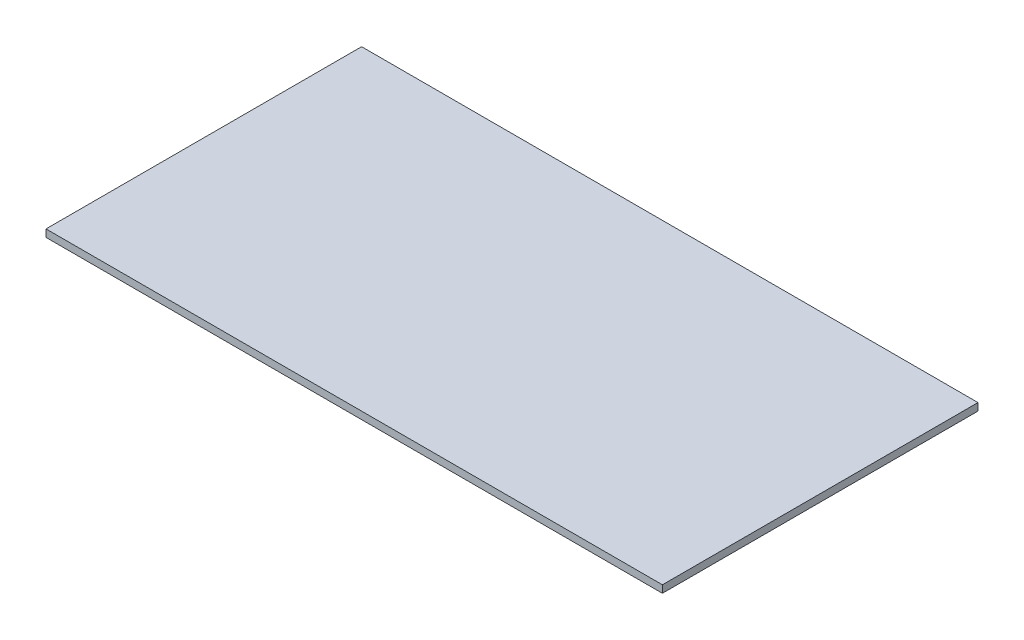
ISO-10303-21;
HEADER;
FILE_DESCRIPTION(('STEP AP214'),'2;1');
FILE_NAME('part.step','',(''),(''),'','','');
FILE_SCHEMA(('AUTOMOTIVE_DESIGN { 1 0 10303 214 1 1 1 1 }'));
ENDSEC;
DATA;
#1=APPLICATION_CONTEXT('core data for automotive mechanical design processes');
#2=APPLICATION_PROTOCOL_DEFINITION('international standard','automotive_design',2000,#1);
#3=PRODUCT_CONTEXT('',#1,'mechanical');
#4=PRODUCT('Part','Part','',(#3));
#5=PRODUCT_RELATED_PRODUCT_CATEGORY('part','',(#4));
#6=PRODUCT_DEFINITION_FORMATION('','',#4);
#7=PRODUCT_DEFINITION_CONTEXT('part definition',#1,'design');
#8=PRODUCT_DEFINITION('design','',#6,#7);
#9=PRODUCT_DEFINITION_SHAPE('','',#8);
#10=(LENGTH_UNIT() NAMED_UNIT(*) SI_UNIT(.MILLI.,.METRE.));
#11=(NAMED_UNIT(*) PLANE_ANGLE_UNIT() SI_UNIT($,.RADIAN.));
#12=(NAMED_UNIT(*) SI_UNIT($,.STERADIAN.) SOLID_ANGLE_UNIT());
#13=UNCERTAINTY_MEASURE_WITH_UNIT(LENGTH_MEASURE(1.E-05),#10,'distance_accuracy_value','');
#14=(GEOMETRIC_REPRESENTATION_CONTEXT(3) GLOBAL_UNCERTAINTY_ASSIGNED_CONTEXT((#13)) GLOBAL_UNIT_ASSIGNED_CONTEXT((#10,
#11,#12)) REPRESENTATION_CONTEXT('',''));
#15=CARTESIAN_POINT('',(0.,0.,0.));
#16=DIRECTION('',(0.,0.,1.));
#17=DIRECTION('',(1.,0.,0.));
#18=AXIS2_PLACEMENT_3D('',#15,#16,#17);
#19=CARTESIAN_POINT('',(0.,3.,0.));
#20=DIRECTION('',(-1.,0.,0.));
#21=DIRECTION('',(0.,0.,1.));
#22=AXIS2_PLACEMENT_3D('',#19,#20,#21);
#23=PLANE('',#22);
#24=DIRECTION('',(0.,0.,-1.));
#25=VECTOR('',#24,1.);
#26=CARTESIAN_POINT('',(0.,0.,0.));
#27=LINE('',#26,#25);
#28=CARTESIAN_POINT('',(0.,0.,0.));
#29=VERTEX_POINT('',#28);
#30=CARTESIAN_POINT('',(0.,0.,-128.));
#31=VERTEX_POINT('',#30);
#32=EDGE_CURVE('E98',#29,#31,#27,.T.);
#33=ORIENTED_EDGE('',*,*,#32,.F.);
#34=DIRECTION('',(0.,-1.,0.));
#35=VECTOR('',#34,1.);
#36=CARTESIAN_POINT('',(0.,3.,0.));
#37=LINE('',#36,#35);
#38=CARTESIAN_POINT('',(0.,3.,0.));
#39=VERTEX_POINT('',#38);
#40=EDGE_CURVE('E11',#39,#29,#37,.T.);
#41=ORIENTED_EDGE('',*,*,#40,.F.);
#42=DIRECTION('',(0.,0.,-1.));
#43=VECTOR('',#42,1.);
#44=CARTESIAN_POINT('',(0.,3.,0.));
#45=LINE('',#44,#43);
#46=CARTESIAN_POINT('',(0.,3.,-128.));
#47=VERTEX_POINT('',#46);
#48=EDGE_CURVE('E93',#39,#47,#45,.T.);
#49=ORIENTED_EDGE('',*,*,#48,.T.);
#50=DIRECTION('',(0.,-1.,0.));
#51=VECTOR('',#50,1.);
#52=CARTESIAN_POINT('',(0.,3.,-128.));
#53=LINE('',#52,#51);
#54=EDGE_CURVE('E36',#47,#31,#53,.T.);
#55=ORIENTED_EDGE('',*,*,#54,.T.);
#56=EDGE_LOOP('',(#33,#41,#49,#55));
#57=FACE_BOUND('',#56,.T.);
#58=ADVANCED_FACE('F33',(#57),#23,.T.);
#59=CARTESIAN_POINT('',(0.,3.,0.));
#60=DIRECTION('',(0.,0.,-1.));
#61=DIRECTION('',(-1.,0.,0.));
#62=AXIS2_PLACEMENT_3D('',#59,#60,#61);
#63=PLANE('',#62);
#64=DIRECTION('',(1.,0.,0.));
#65=VECTOR('',#64,1.);
#66=CARTESIAN_POINT('',(0.,0.,0.));
#67=LINE('',#66,#65);
#68=CARTESIAN_POINT('',(250.,0.,0.));
#69=VERTEX_POINT('',#68);
#70=EDGE_CURVE('E66',#29,#69,#67,.T.);
#71=ORIENTED_EDGE('',*,*,#70,.T.);
#72=DIRECTION('',(0.,-1.,0.));
#73=VECTOR('',#72,1.);
#74=CARTESIAN_POINT('',(250.,3.,0.));
#75=LINE('',#74,#73);
#76=CARTESIAN_POINT('',(250.,3.,0.));
#77=VERTEX_POINT('',#76);
#78=EDGE_CURVE('E42',#77,#69,#75,.T.);
#79=ORIENTED_EDGE('',*,*,#78,.F.);
#80=DIRECTION('',(1.,0.,0.));
#81=VECTOR('',#80,1.);
#82=CARTESIAN_POINT('',(0.,3.,0.));
#83=LINE('',#82,#81);
#84=EDGE_CURVE('E83',#39,#77,#83,.T.);
#85=ORIENTED_EDGE('',*,*,#84,.F.);
#86=ORIENTED_EDGE('',*,*,#40,.T.);
#87=EDGE_LOOP('',(#71,#79,#85,#86));
#88=FACE_BOUND('',#87,.T.);
#89=ADVANCED_FACE('F108',(#88),#63,.F.);
#90=CARTESIAN_POINT('',(250.,3.,0.));
#91=DIRECTION('',(-1.,0.,0.));
#92=DIRECTION('',(0.,0.,1.));
#93=AXIS2_PLACEMENT_3D('',#90,#91,#92);
#94=PLANE('',#93);
#95=DIRECTION('',(0.,0.,-1.));
#96=VECTOR('',#95,1.);
#97=CARTESIAN_POINT('',(250.,0.,0.));
#98=LINE('',#97,#96);
#99=CARTESIAN_POINT('',(250.,0.,-128.));
#100=VERTEX_POINT('',#99);
#101=EDGE_CURVE('E90',#69,#100,#98,.T.);
#102=ORIENTED_EDGE('',*,*,#101,.T.);
#103=DIRECTION('',(0.,-1.,0.));
#104=VECTOR('',#103,1.);
#105=CARTESIAN_POINT('',(250.,3.,-128.));
#106=LINE('',#105,#104);
#107=CARTESIAN_POINT('',(250.,3.,-128.));
#108=VERTEX_POINT('',#107);
#109=EDGE_CURVE('E87',#108,#100,#106,.T.);
#110=ORIENTED_EDGE('',*,*,#109,.F.);
#111=DIRECTION('',(0.,0.,-1.));
#112=VECTOR('',#111,1.);
#113=CARTESIAN_POINT('',(250.,3.,0.));
#114=LINE('',#113,#112);
#115=EDGE_CURVE('E78',#77,#108,#114,.T.);
#116=ORIENTED_EDGE('',*,*,#115,.F.);
#117=ORIENTED_EDGE('',*,*,#78,.T.);
#118=EDGE_LOOP('',(#102,#110,#116,#117));
#119=FACE_BOUND('',#118,.T.);
#120=ADVANCED_FACE('F88',(#119),#94,.F.);
#121=CARTESIAN_POINT('',(0.,3.,-128.));
#122=DIRECTION('',(0.,0.,-1.));
#123=DIRECTION('',(-1.,0.,0.));
#124=AXIS2_PLACEMENT_3D('',#121,#122,#123);
#125=PLANE('',#124);
#126=DIRECTION('',(1.,0.,0.));
#127=VECTOR('',#126,1.);
#128=CARTESIAN_POINT('',(0.,0.,-128.));
#129=LINE('',#128,#127);
#130=EDGE_CURVE('E101',#31,#100,#129,.T.);
#131=ORIENTED_EDGE('',*,*,#130,.F.);
#132=ORIENTED_EDGE('',*,*,#54,.F.);
#133=DIRECTION('',(1.,0.,0.));
#134=VECTOR('',#133,1.);
#135=CARTESIAN_POINT('',(0.,3.,-128.));
#136=LINE('',#135,#134);
#137=EDGE_CURVE('E82',#47,#108,#136,.T.);
#138=ORIENTED_EDGE('',*,*,#137,.T.);
#139=ORIENTED_EDGE('',*,*,#109,.T.);
#140=EDGE_LOOP('',(#131,#132,#138,#139));
#141=FACE_BOUND('',#140,.T.);
#142=ADVANCED_FACE('F92',(#141),#125,.T.);
#143=CARTESIAN_POINT('',(0.,3.,0.));
#144=DIRECTION('',(0.,-1.,0.));
#145=DIRECTION('',(0.,0.,-1.));
#146=AXIS2_PLACEMENT_3D('',#143,#144,#145);
#147=PLANE('',#146);
#148=ORIENTED_EDGE('',*,*,#48,.F.);
#149=ORIENTED_EDGE('',*,*,#84,.T.);
#150=ORIENTED_EDGE('',*,*,#115,.T.);
#151=ORIENTED_EDGE('',*,*,#137,.F.);
#152=EDGE_LOOP('',(#148,#149,#150,#151));
#153=FACE_BOUND('',#152,.T.);
#154=ADVANCED_FACE('F81',(#153),#147,.F.);
#155=CARTESIAN_POINT('',(0.,0.,0.));
#156=DIRECTION('',(0.,-1.,0.));
#157=DIRECTION('',(0.,0.,-1.));
#158=AXIS2_PLACEMENT_3D('',#155,#156,#157);
#159=PLANE('',#158);
#160=ORIENTED_EDGE('',*,*,#32,.T.);
#161=ORIENTED_EDGE('',*,*,#130,.T.);
#162=ORIENTED_EDGE('',*,*,#101,.F.);
#163=ORIENTED_EDGE('',*,*,#70,.F.);
#164=EDGE_LOOP('',(#160,#161,#162,#163));
#165=FACE_BOUND('',#164,.T.);
#166=ADVANCED_FACE('F106',(#165),#159,.T.);
#167=CLOSED_SHELL('',(#58,#89,#120,#142,#154,#166));
#168=MANIFOLD_SOLID_BREP('B2',#167);
#169=ADVANCED_BREP_SHAPE_REPRESENTATION('',(#18,#168),#14);
#170=SHAPE_DEFINITION_REPRESENTATION(#9,#169);
ENDSEC;
END-ISO-10303-21;
